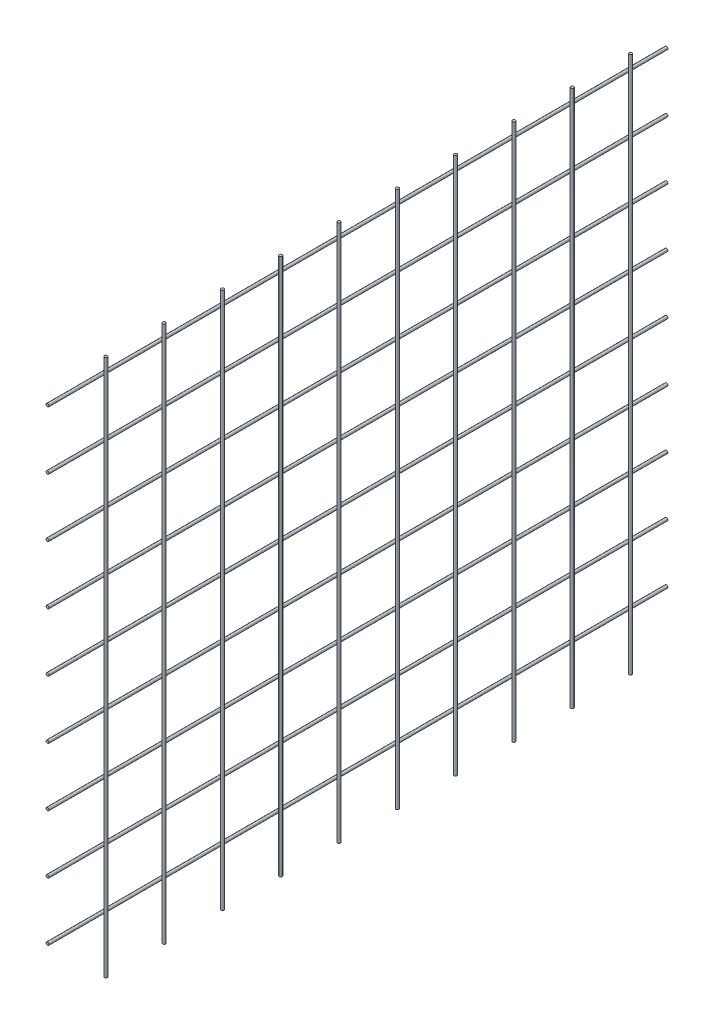
ISO-10303-21;
HEADER;
FILE_DESCRIPTION(('STEP AP214'),'2;1');
FILE_NAME('part.step','',(''),(''),'','','');
FILE_SCHEMA(('AUTOMOTIVE_DESIGN { 1 0 10303 214 1 1 1 1 }'));
ENDSEC;
DATA;
#1=APPLICATION_CONTEXT('core data for automotive mechanical design processes');
#2=APPLICATION_PROTOCOL_DEFINITION('international standard','automotive_design',2000,#1);
#3=PRODUCT_CONTEXT('',#1,'mechanical');
#4=PRODUCT('Part','Part','',(#3));
#5=PRODUCT_RELATED_PRODUCT_CATEGORY('part','',(#4));
#6=PRODUCT_DEFINITION_FORMATION('','',#4);
#7=PRODUCT_DEFINITION_CONTEXT('part definition',#1,'design');
#8=PRODUCT_DEFINITION('design','',#6,#7);
#9=PRODUCT_DEFINITION_SHAPE('','',#8);
#10=(LENGTH_UNIT() NAMED_UNIT(*) SI_UNIT(.MILLI.,.METRE.));
#11=(NAMED_UNIT(*) PLANE_ANGLE_UNIT() SI_UNIT($,.RADIAN.));
#12=(NAMED_UNIT(*) SI_UNIT($,.STERADIAN.) SOLID_ANGLE_UNIT());
#13=UNCERTAINTY_MEASURE_WITH_UNIT(LENGTH_MEASURE(1.E-05),#10,'distance_accuracy_value','');
#14=(GEOMETRIC_REPRESENTATION_CONTEXT(3) GLOBAL_UNCERTAINTY_ASSIGNED_CONTEXT((#13)) GLOBAL_UNIT_ASSIGNED_CONTEXT((#10,
#11,#12)) REPRESENTATION_CONTEXT('',''));
#15=CARTESIAN_POINT('',(0.,0.,0.));
#16=DIRECTION('',(0.,0.,1.));
#17=DIRECTION('',(1.,0.,0.));
#18=AXIS2_PLACEMENT_3D('',#15,#16,#17);
#19=CARTESIAN_POINT('',(1.68094704822153E-12,820.000000000028,-3080.002));
#20=DIRECTION('',(0.,0.,1.));
#21=DIRECTION('',(0.999999999999993,0.,0.));
#22=AXIS2_PLACEMENT_3D('',#19,#20,#21);
#23=CYLINDRICAL_SURFACE('',#22,1.49999999999989);
#24=CARTESIAN_POINT('',(4.56926163572291E-12,820.000000000028,-3040.));
#25=DIRECTION('',(0.,0.,-1.));
#26=DIRECTION('',(-0.999999999999993,0.,0.));
#27=AXIS2_PLACEMENT_3D('',#24,#25,#26);
#28=CIRCLE('',#27,1.49999999999989);
#29=CARTESIAN_POINT('',(-1.49999999999531,820.000000000028,-3040.));
#30=VERTEX_POINT('',#29);
#31=EDGE_CURVE('E11',#30,#30,#28,.T.);
#32=ORIENTED_EDGE('',*,*,#31,.F.);
#33=EDGE_LOOP('',(#32));
#34=FACE_BOUND('',#33,.T.);
#35=CARTESIAN_POINT('',(2.60035049048923E-12,820.000000000025,-2403.));
#36=DIRECTION('',(0.,0.,1.));
#37=DIRECTION('',(0.999999999999993,0.,0.));
#38=AXIS2_PLACEMENT_3D('',#35,#36,#37);
#39=CIRCLE('',#38,1.49999999999989);
#40=CARTESIAN_POINT('',(1.50000000000248,820.000000000025,-2403.));
#41=VERTEX_POINT('',#40);
#42=EDGE_CURVE('E61',#41,#41,#39,.T.);
#43=ORIENTED_EDGE('',*,*,#42,.F.);
#44=EDGE_LOOP('',(#43));
#45=FACE_BOUND('',#44,.T.);
#46=ADVANCED_FACE('F58',(#34,#45),#23,.T.);
#47=CARTESIAN_POINT('',(-15.4999999999984,1.46306577963884E-11,-3040.));
#48=DIRECTION('',(0.,0.,-1.));
#49=DIRECTION('',(-0.999999999999993,0.,0.));
#50=AXIS2_PLACEMENT_3D('',#47,#48,#49);
#51=PLANE('',#50);
#52=ORIENTED_EDGE('',*,*,#31,.T.);
#53=EDGE_LOOP('',(#52));
#54=FACE_BOUND('',#53,.T.);
#55=ADVANCED_FACE('F79',(#54),#51,.T.);
#56=CARTESIAN_POINT('',(-20.0100000000001,1256.50000000002,-2403.00000000001));
#57=DIRECTION('',(0.,0.,1.));
#58=DIRECTION('',(0.999999999999993,0.,0.));
#59=AXIS2_PLACEMENT_3D('',#56,#57,#58);
#60=PLANE('',#59);
#61=ORIENTED_EDGE('',*,*,#42,.T.);
#62=EDGE_LOOP('',(#61));
#63=FACE_BOUND('',#62,.T.);
#64=ADVANCED_FACE('F76',(#63),#60,.T.);
#65=CLOSED_SHELL('',(#46,#55,#64));
#66=MANIFOLD_SOLID_BREP('B2',#65);
#67=CARTESIAN_POINT('',(1.6826817716975E-12,880.000000000028,-3080.002));
#68=DIRECTION('',(0.,0.,1.));
#69=DIRECTION('',(0.999999999999993,0.,0.));
#70=AXIS2_PLACEMENT_3D('',#67,#68,#69);
#71=CYLINDRICAL_SURFACE('',#70,1.49999999999989);
#72=CARTESIAN_POINT('',(4.57099635919889E-12,880.000000000028,-3040.));
#73=DIRECTION('',(0.,0.,-1.));
#74=DIRECTION('',(-0.999999999999993,0.,0.));
#75=AXIS2_PLACEMENT_3D('',#72,#73,#74);
#76=CIRCLE('',#75,1.49999999999989);
#77=CARTESIAN_POINT('',(-1.49999999999531,880.000000000028,-3040.));
#78=VERTEX_POINT('',#77);
#79=EDGE_CURVE('E57',#78,#78,#76,.T.);
#80=ORIENTED_EDGE('',*,*,#79,.F.);
#81=EDGE_LOOP('',(#80));
#82=FACE_BOUND('',#81,.T.);
#83=CARTESIAN_POINT('',(2.60208521396521E-12,880.000000000024,-2403.));
#84=DIRECTION('',(0.,0.,1.));
#85=DIRECTION('',(0.999999999999993,0.,0.));
#86=AXIS2_PLACEMENT_3D('',#83,#84,#85);
#87=CIRCLE('',#86,1.49999999999989);
#88=CARTESIAN_POINT('',(1.50000000000248,880.000000000024,-2403.));
#89=VERTEX_POINT('',#88);
#90=EDGE_CURVE('E110',#89,#89,#87,.T.);
#91=ORIENTED_EDGE('',*,*,#90,.F.);
#92=EDGE_LOOP('',(#91));
#93=FACE_BOUND('',#92,.T.);
#94=ADVANCED_FACE('F107',(#82,#93),#71,.T.);
#95=CARTESIAN_POINT('',(-15.4999999999984,1.46306577963884E-11,-3040.));
#96=DIRECTION('',(0.,0.,-1.));
#97=DIRECTION('',(-0.999999999999993,0.,0.));
#98=AXIS2_PLACEMENT_3D('',#95,#96,#97);
#99=PLANE('',#98);
#100=ORIENTED_EDGE('',*,*,#79,.T.);
#101=EDGE_LOOP('',(#100));
#102=FACE_BOUND('',#101,.T.);
#103=ADVANCED_FACE('F128',(#102),#99,.T.);
#104=CARTESIAN_POINT('',(-20.0100000000001,1256.50000000002,-2403.00000000001));
#105=DIRECTION('',(0.,0.,1.));
#106=DIRECTION('',(0.999999999999993,0.,0.));
#107=AXIS2_PLACEMENT_3D('',#104,#105,#106);
#108=PLANE('',#107);
#109=ORIENTED_EDGE('',*,*,#90,.T.);
#110=EDGE_LOOP('',(#109));
#111=FACE_BOUND('',#110,.T.);
#112=ADVANCED_FACE('F125',(#111),#108,.T.);
#113=CLOSED_SHELL('',(#94,#103,#112));
#114=MANIFOLD_SOLID_BREP('B6',#113);
#115=CARTESIAN_POINT('',(1.68962066560141E-12,1000.00000000003,-3080.002));
#116=DIRECTION('',(0.,0.,1.));
#117=DIRECTION('',(0.999999999999993,0.,0.));
#118=AXIS2_PLACEMENT_3D('',#115,#116,#117);
#119=CYLINDRICAL_SURFACE('',#118,1.49999999999989);
#120=CARTESIAN_POINT('',(4.57793525310279E-12,1000.00000000003,-3040.));
#121=DIRECTION('',(0.,0.,-1.));
#122=DIRECTION('',(-0.999999999999993,0.,0.));
#123=AXIS2_PLACEMENT_3D('',#120,#121,#122);
#124=CIRCLE('',#123,1.49999999999989);
#125=CARTESIAN_POINT('',(-1.4999999999953,1000.00000000003,-3040.));
#126=VERTEX_POINT('',#125);
#127=EDGE_CURVE('E106',#126,#126,#124,.T.);
#128=ORIENTED_EDGE('',*,*,#127,.F.);
#129=EDGE_LOOP('',(#128));
#130=FACE_BOUND('',#129,.T.);
#131=CARTESIAN_POINT('',(3.94129173741931E-12,1000.00000000003,-2403.));
#132=DIRECTION('',(0.,0.,1.));
#133=DIRECTION('',(0.999999999999993,0.,0.));
#134=AXIS2_PLACEMENT_3D('',#131,#132,#133);
#135=CIRCLE('',#134,1.49999999999989);
#136=CARTESIAN_POINT('',(1.50000000000382,1000.00000000003,-2403.));
#137=VERTEX_POINT('',#136);
#138=EDGE_CURVE('E159',#137,#137,#135,.T.);
#139=ORIENTED_EDGE('',*,*,#138,.F.);
#140=EDGE_LOOP('',(#139));
#141=FACE_BOUND('',#140,.T.);
#142=ADVANCED_FACE('F156',(#130,#141),#119,.T.);
#143=CARTESIAN_POINT('',(-15.4999999999984,1.46306577963884E-11,-3040.));
#144=DIRECTION('',(0.,0.,-1.));
#145=DIRECTION('',(-0.999999999999993,0.,0.));
#146=AXIS2_PLACEMENT_3D('',#143,#144,#145);
#147=PLANE('',#146);
#148=ORIENTED_EDGE('',*,*,#127,.T.);
#149=EDGE_LOOP('',(#148));
#150=FACE_BOUND('',#149,.T.);
#151=ADVANCED_FACE('F177',(#150),#147,.T.);
#152=CARTESIAN_POINT('',(-20.0100000000001,1256.50000000002,-2403.00000000001));
#153=DIRECTION('',(0.,0.,1.));
#154=DIRECTION('',(0.999999999999993,0.,0.));
#155=AXIS2_PLACEMENT_3D('',#152,#153,#154);
#156=PLANE('',#155);
#157=ORIENTED_EDGE('',*,*,#138,.T.);
#158=EDGE_LOOP('',(#157));
#159=FACE_BOUND('',#158,.T.);
#160=ADVANCED_FACE('F174',(#159),#156,.T.);
#161=CLOSED_SHELL('',(#142,#151,#160));
#162=MANIFOLD_SOLID_BREP('B52',#161);
#163=CARTESIAN_POINT('',(1.68615121864946E-12,940.000000000028,-3080.002));
#164=DIRECTION('',(0.,0.,1.));
#165=DIRECTION('',(0.999999999999993,0.,0.));
#166=AXIS2_PLACEMENT_3D('',#163,#164,#165);
#167=CYLINDRICAL_SURFACE('',#166,1.49999999999989);
#168=CARTESIAN_POINT('',(4.57446580615084E-12,940.000000000028,-3040.));
#169=DIRECTION('',(0.,0.,-1.));
#170=DIRECTION('',(-0.999999999999993,0.,0.));
#171=AXIS2_PLACEMENT_3D('',#168,#169,#170);
#172=CIRCLE('',#171,1.49999999999989);
#173=CARTESIAN_POINT('',(-1.4999999999953,940.000000000028,-3040.));
#174=VERTEX_POINT('',#173);
#175=EDGE_CURVE('E155',#174,#174,#172,.T.);
#176=ORIENTED_EDGE('',*,*,#175,.F.);
#177=EDGE_LOOP('',(#176));
#178=FACE_BOUND('',#177,.T.);
#179=CARTESIAN_POINT('',(3.93782229046735E-12,940.000000000026,-2403.));
#180=DIRECTION('',(0.,0.,1.));
#181=DIRECTION('',(0.999999999999993,0.,0.));
#182=AXIS2_PLACEMENT_3D('',#179,#180,#181);
#183=CIRCLE('',#182,1.49999999999989);
#184=CARTESIAN_POINT('',(1.50000000000381,940.000000000026,-2403.));
#185=VERTEX_POINT('',#184);
#186=EDGE_CURVE('E208',#185,#185,#183,.T.);
#187=ORIENTED_EDGE('',*,*,#186,.F.);
#188=EDGE_LOOP('',(#187));
#189=FACE_BOUND('',#188,.T.);
#190=ADVANCED_FACE('F205',(#178,#189),#167,.T.);
#191=CARTESIAN_POINT('',(-15.4999999999984,1.46306577963884E-11,-3040.));
#192=DIRECTION('',(0.,0.,-1.));
#193=DIRECTION('',(-0.999999999999993,0.,0.));
#194=AXIS2_PLACEMENT_3D('',#191,#192,#193);
#195=PLANE('',#194);
#196=ORIENTED_EDGE('',*,*,#175,.T.);
#197=EDGE_LOOP('',(#196));
#198=FACE_BOUND('',#197,.T.);
#199=ADVANCED_FACE('F226',(#198),#195,.T.);
#200=CARTESIAN_POINT('',(-20.0100000000001,1256.50000000002,-2403.00000000001));
#201=DIRECTION('',(0.,0.,1.));
#202=DIRECTION('',(0.999999999999993,0.,0.));
#203=AXIS2_PLACEMENT_3D('',#200,#201,#202);
#204=PLANE('',#203);
#205=ORIENTED_EDGE('',*,*,#186,.T.);
#206=EDGE_LOOP('',(#205));
#207=FACE_BOUND('',#206,.T.);
#208=ADVANCED_FACE('F223',(#207),#204,.T.);
#209=CLOSED_SHELL('',(#190,#199,#208));
#210=MANIFOLD_SOLID_BREP('B101',#209);
#211=CARTESIAN_POINT('',(1.69309011255336E-12,1060.00000000003,-3080.002));
#212=DIRECTION('',(0.,0.,1.));
#213=DIRECTION('',(0.999999999999993,0.,0.));
#214=AXIS2_PLACEMENT_3D('',#211,#212,#213);
#215=CYLINDRICAL_SURFACE('',#214,1.49999999999989);
#216=CARTESIAN_POINT('',(4.58140470005475E-12,1060.00000000003,-3040.));
#217=DIRECTION('',(0.,0.,-1.));
#218=DIRECTION('',(-0.999999999999993,0.,0.));
#219=AXIS2_PLACEMENT_3D('',#216,#217,#218);
#220=CIRCLE('',#219,1.49999999999989);
#221=CARTESIAN_POINT('',(-1.49999999999529,1060.00000000003,-3040.));
#222=VERTEX_POINT('',#221);
#223=EDGE_CURVE('E204',#222,#222,#220,.T.);
#224=ORIENTED_EDGE('',*,*,#223,.F.);
#225=EDGE_LOOP('',(#224));
#226=FACE_BOUND('',#225,.T.);
#227=CARTESIAN_POINT('',(3.94476118437126E-12,1060.00000000003,-2403.));
#228=DIRECTION('',(0.,0.,1.));
#229=DIRECTION('',(0.999999999999993,0.,0.));
#230=AXIS2_PLACEMENT_3D('',#227,#228,#229);
#231=CIRCLE('',#230,1.49999999999989);
#232=CARTESIAN_POINT('',(1.50000000000382,1060.00000000003,-2403.));
#233=VERTEX_POINT('',#232);
#234=EDGE_CURVE('E257',#233,#233,#231,.T.);
#235=ORIENTED_EDGE('',*,*,#234,.F.);
#236=EDGE_LOOP('',(#235));
#237=FACE_BOUND('',#236,.T.);
#238=ADVANCED_FACE('F254',(#226,#237),#215,.T.);
#239=CARTESIAN_POINT('',(-15.4999999999984,1.46306577963884E-11,-3040.));
#240=DIRECTION('',(0.,0.,-1.));
#241=DIRECTION('',(-0.999999999999993,0.,0.));
#242=AXIS2_PLACEMENT_3D('',#239,#240,#241);
#243=PLANE('',#242);
#244=ORIENTED_EDGE('',*,*,#223,.T.);
#245=EDGE_LOOP('',(#244));
#246=FACE_BOUND('',#245,.T.);
#247=ADVANCED_FACE('F275',(#246),#243,.T.);
#248=CARTESIAN_POINT('',(-20.0100000000001,1256.50000000002,-2403.00000000001));
#249=DIRECTION('',(0.,0.,1.));
#250=DIRECTION('',(0.999999999999993,0.,0.));
#251=AXIS2_PLACEMENT_3D('',#248,#249,#250);
#252=PLANE('',#251);
#253=ORIENTED_EDGE('',*,*,#234,.T.);
#254=EDGE_LOOP('',(#253));
#255=FACE_BOUND('',#254,.T.);
#256=ADVANCED_FACE('F272',(#255),#252,.T.);
#257=CLOSED_SHELL('',(#238,#247,#256));
#258=MANIFOLD_SOLID_BREP('B150',#257);
#259=CARTESIAN_POINT('',(4.58313942353072E-12,1120.00000000003,-3080.002));
#260=DIRECTION('',(0.,0.,1.));
#261=DIRECTION('',(0.999999999999993,0.,0.));
#262=AXIS2_PLACEMENT_3D('',#259,#260,#261);
#263=CYLINDRICAL_SURFACE('',#262,1.49999999999989);
#264=CARTESIAN_POINT('',(4.80691875193173E-12,1120.00000000003,-3040.));
#265=DIRECTION('',(0.,0.,-1.));
#266=DIRECTION('',(-0.999999999999993,0.,0.));
#267=AXIS2_PLACEMENT_3D('',#264,#265,#266);
#268=CIRCLE('',#267,1.49999999999989);
#269=CARTESIAN_POINT('',(-1.49999999999507,1120.00000000003,-3040.));
#270=VERTEX_POINT('',#269);
#271=EDGE_CURVE('E253',#270,#270,#268,.T.);
#272=ORIENTED_EDGE('',*,*,#271,.F.);
#273=EDGE_LOOP('',(#272));
#274=FACE_BOUND('',#273,.T.);
#275=CARTESIAN_POINT('',(4.17027523624824E-12,1120.00000000003,-2403.));
#276=DIRECTION('',(0.,0.,1.));
#277=DIRECTION('',(0.999999999999993,0.,0.));
#278=AXIS2_PLACEMENT_3D('',#275,#276,#277);
#279=CIRCLE('',#278,1.49999999999989);
#280=CARTESIAN_POINT('',(1.50000000000405,1120.00000000003,-2403.));
#281=VERTEX_POINT('',#280);
#282=EDGE_CURVE('E306',#281,#281,#279,.T.);
#283=ORIENTED_EDGE('',*,*,#282,.F.);
#284=EDGE_LOOP('',(#283));
#285=FACE_BOUND('',#284,.T.);
#286=ADVANCED_FACE('F303',(#274,#285),#263,.T.);
#287=CARTESIAN_POINT('',(-15.4999999999984,1.46306577963884E-11,-3040.));
#288=DIRECTION('',(0.,0.,-1.));
#289=DIRECTION('',(-0.999999999999993,0.,0.));
#290=AXIS2_PLACEMENT_3D('',#287,#288,#289);
#291=PLANE('',#290);
#292=ORIENTED_EDGE('',*,*,#271,.T.);
#293=EDGE_LOOP('',(#292));
#294=FACE_BOUND('',#293,.T.);
#295=ADVANCED_FACE('F324',(#294),#291,.T.);
#296=CARTESIAN_POINT('',(-20.0100000000001,1256.50000000002,-2403.00000000001));
#297=DIRECTION('',(0.,0.,1.));
#298=DIRECTION('',(0.999999999999993,0.,0.));
#299=AXIS2_PLACEMENT_3D('',#296,#297,#298);
#300=PLANE('',#299);
#301=ORIENTED_EDGE('',*,*,#282,.T.);
#302=EDGE_LOOP('',(#301));
#303=FACE_BOUND('',#302,.T.);
#304=ADVANCED_FACE('F321',(#303),#300,.T.);
#305=CLOSED_SHELL('',(#286,#295,#304));
#306=MANIFOLD_SOLID_BREP('B199',#305);
#307=CARTESIAN_POINT('',(4.58660887048268E-12,1180.00000000003,-3080.002));
#308=DIRECTION('',(0.,0.,1.));
#309=DIRECTION('',(0.999999999999993,0.,0.));
#310=AXIS2_PLACEMENT_3D('',#307,#308,#309);
#311=CYLINDRICAL_SURFACE('',#310,1.49999999999989);
#312=CARTESIAN_POINT('',(4.81038819888369E-12,1180.00000000003,-3040.));
#313=DIRECTION('',(0.,0.,-1.));
#314=DIRECTION('',(-0.999999999999993,0.,0.));
#315=AXIS2_PLACEMENT_3D('',#312,#313,#314);
#316=CIRCLE('',#315,1.49999999999989);
#317=CARTESIAN_POINT('',(-1.49999999999507,1180.00000000003,-3040.));
#318=VERTEX_POINT('',#317);
#319=EDGE_CURVE('E302',#318,#318,#316,.T.);
#320=ORIENTED_EDGE('',*,*,#319,.F.);
#321=EDGE_LOOP('',(#320));
#322=FACE_BOUND('',#321,.T.);
#323=CARTESIAN_POINT('',(4.1737446832002E-12,1180.00000000003,-2403.));
#324=DIRECTION('',(0.,0.,1.));
#325=DIRECTION('',(0.999999999999993,0.,0.));
#326=AXIS2_PLACEMENT_3D('',#323,#324,#325);
#327=CIRCLE('',#326,1.49999999999989);
#328=CARTESIAN_POINT('',(1.50000000000405,1180.00000000003,-2403.));
#329=VERTEX_POINT('',#328);
#330=EDGE_CURVE('E355',#329,#329,#327,.T.);
#331=ORIENTED_EDGE('',*,*,#330,.F.);
#332=EDGE_LOOP('',(#331));
#333=FACE_BOUND('',#332,.T.);
#334=ADVANCED_FACE('F352',(#322,#333),#311,.T.);
#335=CARTESIAN_POINT('',(-15.4999999999984,1.46306577963884E-11,-3040.));
#336=DIRECTION('',(0.,0.,-1.));
#337=DIRECTION('',(-0.999999999999993,0.,0.));
#338=AXIS2_PLACEMENT_3D('',#335,#336,#337);
#339=PLANE('',#338);
#340=ORIENTED_EDGE('',*,*,#319,.T.);
#341=EDGE_LOOP('',(#340));
#342=FACE_BOUND('',#341,.T.);
#343=ADVANCED_FACE('F373',(#342),#339,.T.);
#344=CARTESIAN_POINT('',(-20.0100000000001,1256.50000000002,-2403.00000000001));
#345=DIRECTION('',(0.,0.,1.));
#346=DIRECTION('',(0.999999999999993,0.,0.));
#347=AXIS2_PLACEMENT_3D('',#344,#345,#346);
#348=PLANE('',#347);
#349=ORIENTED_EDGE('',*,*,#330,.T.);
#350=EDGE_LOOP('',(#349));
#351=FACE_BOUND('',#350,.T.);
#352=ADVANCED_FACE('F370',(#351),#348,.T.);
#353=CLOSED_SHELL('',(#334,#343,#352));
#354=MANIFOLD_SOLID_BREP('B248',#353);
#355=CARTESIAN_POINT('',(4.81038819888369E-12,1240.00000000003,-3080.002));
#356=DIRECTION('',(0.,0.,1.));
#357=DIRECTION('',(0.999999999999993,0.,0.));
#358=AXIS2_PLACEMENT_3D('',#355,#356,#357);
#359=CYLINDRICAL_SURFACE('',#358,1.49999999999989);
#360=CARTESIAN_POINT('',(4.81212292235966E-12,1240.00000000003,-3040.));
#361=DIRECTION('',(0.,0.,-1.));
#362=DIRECTION('',(-0.999999999999993,0.,0.));
#363=AXIS2_PLACEMENT_3D('',#360,#361,#362);
#364=CIRCLE('',#363,1.49999999999989);
#365=CARTESIAN_POINT('',(-1.49999999999506,1240.00000000003,-3040.));
#366=VERTEX_POINT('',#365);
#367=EDGE_CURVE('E351',#366,#366,#364,.T.);
#368=ORIENTED_EDGE('',*,*,#367,.F.);
#369=EDGE_LOOP('',(#368));
#370=FACE_BOUND('',#369,.T.);
#371=CARTESIAN_POINT('',(4.17547940667617E-12,1240.00000000003,-2403.));
#372=DIRECTION('',(0.,0.,1.));
#373=DIRECTION('',(0.999999999999993,0.,0.));
#374=AXIS2_PLACEMENT_3D('',#371,#372,#373);
#375=CIRCLE('',#374,1.49999999999989);
#376=CARTESIAN_POINT('',(1.50000000000405,1240.00000000003,-2403.));
#377=VERTEX_POINT('',#376);
#378=EDGE_CURVE('E404',#377,#377,#375,.T.);
#379=ORIENTED_EDGE('',*,*,#378,.F.);
#380=EDGE_LOOP('',(#379));
#381=FACE_BOUND('',#380,.T.);
#382=ADVANCED_FACE('F401',(#370,#381),#359,.T.);
#383=CARTESIAN_POINT('',(-15.4999999999984,1.46306577963884E-11,-3040.));
#384=DIRECTION('',(0.,0.,-1.));
#385=DIRECTION('',(-0.999999999999993,0.,0.));
#386=AXIS2_PLACEMENT_3D('',#383,#384,#385);
#387=PLANE('',#386);
#388=ORIENTED_EDGE('',*,*,#367,.T.);
#389=EDGE_LOOP('',(#388));
#390=FACE_BOUND('',#389,.T.);
#391=ADVANCED_FACE('F422',(#390),#387,.T.);
#392=CARTESIAN_POINT('',(-20.0100000000001,1256.50000000002,-2403.00000000001));
#393=DIRECTION('',(0.,0.,1.));
#394=DIRECTION('',(0.999999999999993,0.,0.));
#395=AXIS2_PLACEMENT_3D('',#392,#393,#394);
#396=PLANE('',#395);
#397=ORIENTED_EDGE('',*,*,#378,.T.);
#398=EDGE_LOOP('',(#397));
#399=FACE_BOUND('',#398,.T.);
#400=ADVANCED_FACE('F419',(#399),#396,.T.);
#401=CLOSED_SHELL('',(#382,#391,#400));
#402=MANIFOLD_SOLID_BREP('B297',#401);
#403=CARTESIAN_POINT('',(3.0000000000043,1980.00200000004,-3000.00000000001));
#404=DIRECTION('',(0.,-1.00000000000001,0.));
#405=DIRECTION('',(0.,0.,-1.));
#406=AXIS2_PLACEMENT_3D('',#403,#404,#405);
#407=CYLINDRICAL_SURFACE('',#406,1.5);
#408=CARTESIAN_POINT('',(3.00000000000249,1256.50000000003,-3000.));
#409=DIRECTION('',(0.,1.00000000000001,0.));
#410=DIRECTION('',(0.,0.,1.));
#411=AXIS2_PLACEMENT_3D('',#408,#409,#410);
#412=CIRCLE('',#411,1.5);
#413=CARTESIAN_POINT('',(3.00000000000249,1256.50000000003,-2998.5));
#414=VERTEX_POINT('',#413);
#415=EDGE_CURVE('E457',#414,#414,#412,.T.);
#416=ORIENTED_EDGE('',*,*,#415,.F.);
#417=EDGE_LOOP('',(#416));
#418=FACE_BOUND('',#417,.T.);
#419=CARTESIAN_POINT('',(3.00000000000357,703.500000000023,-3000.));
#420=DIRECTION('',(0.,-1.00000000000001,0.));
#421=DIRECTION('',(0.,0.,-1.));
#422=AXIS2_PLACEMENT_3D('',#419,#420,#421);
#423=CIRCLE('',#422,1.5);
#424=CARTESIAN_POINT('',(3.00000000000357,703.500000000023,-3001.5));
#425=VERTEX_POINT('',#424);
#426=EDGE_CURVE('E400',#425,#425,#423,.T.);
#427=ORIENTED_EDGE('',*,*,#426,.F.);
#428=EDGE_LOOP('',(#427));
#429=FACE_BOUND('',#428,.T.);
#430=ADVANCED_FACE('F450',(#418,#429),#407,.T.);
#431=CARTESIAN_POINT('',(-20.0100000000001,1256.50000000002,-2403.00000000001));
#432=DIRECTION('',(0.,1.00000000000001,0.));
#433=DIRECTION('',(0.,0.,1.));
#434=AXIS2_PLACEMENT_3D('',#431,#432,#433);
#435=PLANE('',#434);
#436=ORIENTED_EDGE('',*,*,#415,.T.);
#437=EDGE_LOOP('',(#436));
#438=FACE_BOUND('',#437,.T.);
#439=ADVANCED_FACE('F468',(#438),#435,.T.);
#440=CARTESIAN_POINT('',(-20.0099999999975,703.500000000021,-2403.00000000001));
#441=DIRECTION('',(0.,-1.00000000000001,0.));
#442=DIRECTION('',(0.,0.,-1.));
#443=AXIS2_PLACEMENT_3D('',#440,#441,#442);
#444=PLANE('',#443);
#445=ORIENTED_EDGE('',*,*,#426,.T.);
#446=EDGE_LOOP('',(#445));
#447=FACE_BOUND('',#446,.T.);
#448=ADVANCED_FACE('F472',(#447),#444,.T.);
#449=CLOSED_SHELL('',(#430,#439,#448));
#450=MANIFOLD_SOLID_BREP('B346',#449);
#451=CARTESIAN_POINT('',(3.0000000000063,1980.00200000004,-2940.00000000001));
#452=DIRECTION('',(0.,-1.00000000000001,0.));
#453=DIRECTION('',(0.,0.,-1.));
#454=AXIS2_PLACEMENT_3D('',#451,#452,#453);
#455=CYLINDRICAL_SURFACE('',#454,1.5);
#456=CARTESIAN_POINT('',(3.00000000000182,1256.50000000003,-2940.));
#457=DIRECTION('',(0.,1.00000000000001,0.));
#458=DIRECTION('',(0.,0.,1.));
#459=AXIS2_PLACEMENT_3D('',#456,#457,#458);
#460=CIRCLE('',#459,1.5);
#461=CARTESIAN_POINT('',(3.00000000000182,1256.50000000003,-2938.5));
#462=VERTEX_POINT('',#461);
#463=EDGE_CURVE('E509',#462,#462,#460,.T.);
#464=ORIENTED_EDGE('',*,*,#463,.F.);
#465=EDGE_LOOP('',(#464));
#466=FACE_BOUND('',#465,.T.);
#467=CARTESIAN_POINT('',(3.00000000000446,703.500000000023,-2940.));
#468=DIRECTION('',(0.,-1.00000000000001,0.));
#469=DIRECTION('',(0.,0.,-1.));
#470=AXIS2_PLACEMENT_3D('',#467,#468,#469);
#471=CIRCLE('',#470,1.5);
#472=CARTESIAN_POINT('',(3.00000000000446,703.500000000023,-2941.5));
#473=VERTEX_POINT('',#472);
#474=EDGE_CURVE('E449',#473,#473,#471,.T.);
#475=ORIENTED_EDGE('',*,*,#474,.F.);
#476=EDGE_LOOP('',(#475));
#477=FACE_BOUND('',#476,.T.);
#478=ADVANCED_FACE('F502',(#466,#477),#455,.T.);
#479=CARTESIAN_POINT('',(-20.0100000000001,1256.50000000002,-2403.00000000001));
#480=DIRECTION('',(0.,1.00000000000001,0.));
#481=DIRECTION('',(0.,0.,1.));
#482=AXIS2_PLACEMENT_3D('',#479,#480,#481);
#483=PLANE('',#482);
#484=ORIENTED_EDGE('',*,*,#463,.T.);
#485=EDGE_LOOP('',(#484));
#486=FACE_BOUND('',#485,.T.);
#487=ADVANCED_FACE('F520',(#486),#483,.T.);
#488=CARTESIAN_POINT('',(-20.0099999999975,703.500000000021,-2403.00000000001));
#489=DIRECTION('',(0.,-1.00000000000001,0.));
#490=DIRECTION('',(0.,0.,-1.));
#491=AXIS2_PLACEMENT_3D('',#488,#489,#490);
#492=PLANE('',#491);
#493=ORIENTED_EDGE('',*,*,#474,.T.);
#494=EDGE_LOOP('',(#493));
#495=FACE_BOUND('',#494,.T.);
#496=ADVANCED_FACE('F524',(#495),#492,.T.);
#497=CLOSED_SHELL('',(#478,#487,#496));
#498=MANIFOLD_SOLID_BREP('B395',#497);
#499=CARTESIAN_POINT('',(3.00000000000233,1980.00200000003,-2880.00000000001));
#500=DIRECTION('',(0.,-1.00000000000001,0.));
#501=DIRECTION('',(0.,0.,-1.));
#502=AXIS2_PLACEMENT_3D('',#499,#500,#501);
#503=CYLINDRICAL_SURFACE('',#502,1.5);
#504=CARTESIAN_POINT('',(3.00000000000167,1256.50000000002,-2880.));
#505=DIRECTION('',(0.,1.00000000000001,0.));
#506=DIRECTION('',(0.,0.,1.));
#507=AXIS2_PLACEMENT_3D('',#504,#505,#506);
#508=CIRCLE('',#507,1.5);
#509=CARTESIAN_POINT('',(3.00000000000167,1256.50000000002,-2878.5));
#510=VERTEX_POINT('',#509);
#511=EDGE_CURVE('E564',#510,#510,#508,.T.);
#512=ORIENTED_EDGE('',*,*,#511,.F.);
#513=EDGE_LOOP('',(#512));
#514=FACE_BOUND('',#513,.T.);
#515=CARTESIAN_POINT('',(3.00000000000189,703.500000000017,-2880.));
#516=DIRECTION('',(0.,-1.00000000000001,0.));
#517=DIRECTION('',(0.,0.,-1.));
#518=AXIS2_PLACEMENT_3D('',#515,#516,#517);
#519=CIRCLE('',#518,1.5);
#520=CARTESIAN_POINT('',(3.00000000000189,703.500000000017,-2881.5));
#521=VERTEX_POINT('',#520);
#522=EDGE_CURVE('E501',#521,#521,#519,.T.);
#523=ORIENTED_EDGE('',*,*,#522,.F.);
#524=EDGE_LOOP('',(#523));
#525=FACE_BOUND('',#524,.T.);
#526=ADVANCED_FACE('F557',(#514,#525),#503,.T.);
#527=CARTESIAN_POINT('',(-20.0100000000001,1256.50000000002,-2403.00000000001));
#528=DIRECTION('',(0.,1.00000000000001,0.));
#529=DIRECTION('',(0.,0.,1.));
#530=AXIS2_PLACEMENT_3D('',#527,#528,#529);
#531=PLANE('',#530);
#532=ORIENTED_EDGE('',*,*,#511,.T.);
#533=EDGE_LOOP('',(#532));
#534=FACE_BOUND('',#533,.T.);
#535=ADVANCED_FACE('F575',(#534),#531,.T.);
#536=CARTESIAN_POINT('',(-20.0099999999961,703.500000000016,-2403.00000000001));
#537=DIRECTION('',(0.,-1.00000000000001,0.));
#538=DIRECTION('',(0.,0.,-1.));
#539=AXIS2_PLACEMENT_3D('',#536,#537,#538);
#540=PLANE('',#539);
#541=ORIENTED_EDGE('',*,*,#522,.T.);
#542=EDGE_LOOP('',(#541));
#543=FACE_BOUND('',#542,.T.);
#544=ADVANCED_FACE('F579',(#543),#540,.T.);
#545=CLOSED_SHELL('',(#526,#535,#544));
#546=MANIFOLD_SOLID_BREP('B444',#545);
#547=CARTESIAN_POINT('',(3.00000000000433,1980.00200000003,-2820.00000000001));
#548=DIRECTION('',(0.,-1.00000000000001,0.));
#549=DIRECTION('',(0.,0.,-1.));
#550=AXIS2_PLACEMENT_3D('',#547,#548,#549);
#551=CYLINDRICAL_SURFACE('',#550,1.5);
#552=CARTESIAN_POINT('',(3.00000000000389,1256.50000000002,-2820.));
#553=DIRECTION('',(0.,1.00000000000001,0.));
#554=DIRECTION('',(0.,0.,1.));
#555=AXIS2_PLACEMENT_3D('',#552,#553,#554);
#556=CIRCLE('',#555,1.5);
#557=CARTESIAN_POINT('',(3.00000000000389,1256.50000000002,-2818.5));
#558=VERTEX_POINT('',#557);
#559=EDGE_CURVE('E614',#558,#558,#556,.T.);
#560=ORIENTED_EDGE('',*,*,#559,.F.);
#561=EDGE_LOOP('',(#560));
#562=FACE_BOUND('',#561,.T.);
#563=CARTESIAN_POINT('',(3.00000000000389,703.500000000017,-2820.));
#564=DIRECTION('',(0.,-1.00000000000001,0.));
#565=DIRECTION('',(0.,0.,-1.));
#566=AXIS2_PLACEMENT_3D('',#563,#564,#565);
#567=CIRCLE('',#566,1.5);
#568=CARTESIAN_POINT('',(3.00000000000389,703.500000000017,-2821.5));
#569=VERTEX_POINT('',#568);
#570=EDGE_CURVE('E556',#569,#569,#567,.T.);
#571=ORIENTED_EDGE('',*,*,#570,.F.);
#572=EDGE_LOOP('',(#571));
#573=FACE_BOUND('',#572,.T.);
#574=ADVANCED_FACE('F607',(#562,#573),#551,.T.);
#575=CARTESIAN_POINT('',(-20.0100000000001,1256.50000000002,-2403.00000000001));
#576=DIRECTION('',(0.,1.00000000000001,0.));
#577=DIRECTION('',(0.,0.,1.));
#578=AXIS2_PLACEMENT_3D('',#575,#576,#577);
#579=PLANE('',#578);
#580=ORIENTED_EDGE('',*,*,#559,.T.);
#581=EDGE_LOOP('',(#580));
#582=FACE_BOUND('',#581,.T.);
#583=ADVANCED_FACE('F625',(#582),#579,.T.);
#584=CARTESIAN_POINT('',(-20.0099999999961,703.500000000016,-2403.00000000001));
#585=DIRECTION('',(0.,-1.00000000000001,0.));
#586=DIRECTION('',(0.,0.,-1.));
#587=AXIS2_PLACEMENT_3D('',#584,#585,#586);
#588=PLANE('',#587);
#589=ORIENTED_EDGE('',*,*,#570,.T.);
#590=EDGE_LOOP('',(#589));
#591=FACE_BOUND('',#590,.T.);
#592=ADVANCED_FACE('F629',(#591),#588,.T.);
#593=CLOSED_SHELL('',(#574,#583,#592));
#594=MANIFOLD_SOLID_BREP('B496',#593);
#595=CARTESIAN_POINT('',(3.00000000000411,1980.00200000003,-2760.00000000001));
#596=DIRECTION('',(0.,-1.00000000000001,0.));
#597=DIRECTION('',(0.,0.,-1.));
#598=AXIS2_PLACEMENT_3D('',#595,#596,#597);
#599=CYLINDRICAL_SURFACE('',#598,1.5);
#600=CARTESIAN_POINT('',(2.99999999999989,1256.50000000002,-2760.));
#601=DIRECTION('',(0.,1.00000000000001,0.));
#602=DIRECTION('',(0.,0.,1.));
#603=AXIS2_PLACEMENT_3D('',#600,#601,#602);
#604=CIRCLE('',#603,1.5);
#605=CARTESIAN_POINT('',(2.99999999999989,1256.50000000002,-2758.5));
#606=VERTEX_POINT('',#605);
#607=EDGE_CURVE('E663',#606,#606,#604,.T.);
#608=ORIENTED_EDGE('',*,*,#607,.F.);
#609=EDGE_LOOP('',(#608));
#610=FACE_BOUND('',#609,.T.);
#611=CARTESIAN_POINT('',(3.00000000000367,703.500000000017,-2760.));
#612=DIRECTION('',(0.,-1.00000000000001,0.));
#613=DIRECTION('',(0.,0.,-1.));
#614=AXIS2_PLACEMENT_3D('',#611,#612,#613);
#615=CIRCLE('',#614,1.5);
#616=CARTESIAN_POINT('',(3.00000000000367,703.500000000017,-2761.5));
#617=VERTEX_POINT('',#616);
#618=EDGE_CURVE('E606',#617,#617,#615,.T.);
#619=ORIENTED_EDGE('',*,*,#618,.F.);
#620=EDGE_LOOP('',(#619));
#621=FACE_BOUND('',#620,.T.);
#622=ADVANCED_FACE('F656',(#610,#621),#599,.T.);
#623=CARTESIAN_POINT('',(-20.0100000000001,1256.50000000002,-2403.00000000001));
#624=DIRECTION('',(0.,1.00000000000001,0.));
#625=DIRECTION('',(0.,0.,1.));
#626=AXIS2_PLACEMENT_3D('',#623,#624,#625);
#627=PLANE('',#626);
#628=ORIENTED_EDGE('',*,*,#607,.T.);
#629=EDGE_LOOP('',(#628));
#630=FACE_BOUND('',#629,.T.);
#631=ADVANCED_FACE('F674',(#630),#627,.T.);
#632=CARTESIAN_POINT('',(-20.0099999999961,703.500000000016,-2403.00000000001));
#633=DIRECTION('',(0.,-1.00000000000001,0.));
#634=DIRECTION('',(0.,0.,-1.));
#635=AXIS2_PLACEMENT_3D('',#632,#633,#634);
#636=PLANE('',#635);
#637=ORIENTED_EDGE('',*,*,#618,.T.);
#638=EDGE_LOOP('',(#637));
#639=FACE_BOUND('',#638,.T.);
#640=ADVANCED_FACE('F678',(#639),#636,.T.);
#641=CLOSED_SHELL('',(#622,#631,#640));
#642=MANIFOLD_SOLID_BREP('B551',#641);
#643=CARTESIAN_POINT('',(3.00000000000233,1980.00200000003,-2700.00000000001));
#644=DIRECTION('',(0.,-1.00000000000001,0.));
#645=DIRECTION('',(0.,0.,-1.));
#646=AXIS2_PLACEMENT_3D('',#643,#644,#645);
#647=CYLINDRICAL_SURFACE('',#646,1.5);
#648=CARTESIAN_POINT('',(3.00000000000167,1256.50000000002,-2700.));
#649=DIRECTION('',(0.,1.00000000000001,0.));
#650=DIRECTION('',(0.,0.,1.));
#651=AXIS2_PLACEMENT_3D('',#648,#649,#650);
#652=CIRCLE('',#651,1.5);
#653=CARTESIAN_POINT('',(3.00000000000167,1256.50000000002,-2698.5));
#654=VERTEX_POINT('',#653);
#655=EDGE_CURVE('E712',#654,#654,#652,.T.);
#656=ORIENTED_EDGE('',*,*,#655,.F.);
#657=EDGE_LOOP('',(#656));
#658=FACE_BOUND('',#657,.T.);
#659=CARTESIAN_POINT('',(3.00000000000189,703.500000000017,-2700.));
#660=DIRECTION('',(0.,-1.00000000000001,0.));
#661=DIRECTION('',(0.,0.,-1.));
#662=AXIS2_PLACEMENT_3D('',#659,#660,#661);
#663=CIRCLE('',#662,1.5);
#664=CARTESIAN_POINT('',(3.00000000000189,703.500000000017,-2701.5));
#665=VERTEX_POINT('',#664);
#666=EDGE_CURVE('E655',#665,#665,#663,.T.);
#667=ORIENTED_EDGE('',*,*,#666,.F.);
#668=EDGE_LOOP('',(#667));
#669=FACE_BOUND('',#668,.T.);
#670=ADVANCED_FACE('F705',(#658,#669),#647,.T.);
#671=CARTESIAN_POINT('',(-20.0100000000001,1256.50000000002,-2403.00000000001));
#672=DIRECTION('',(0.,1.00000000000001,0.));
#673=DIRECTION('',(0.,0.,1.));
#674=AXIS2_PLACEMENT_3D('',#671,#672,#673);
#675=PLANE('',#674);
#676=ORIENTED_EDGE('',*,*,#655,.T.);
#677=EDGE_LOOP('',(#676));
#678=FACE_BOUND('',#677,.T.);
#679=ADVANCED_FACE('F723',(#678),#675,.T.);
#680=CARTESIAN_POINT('',(-20.0099999999961,703.500000000016,-2403.00000000001));
#681=DIRECTION('',(0.,-1.00000000000001,0.));
#682=DIRECTION('',(0.,0.,-1.));
#683=AXIS2_PLACEMENT_3D('',#680,#681,#682);
#684=PLANE('',#683);
#685=ORIENTED_EDGE('',*,*,#666,.T.);
#686=EDGE_LOOP('',(#685));
#687=FACE_BOUND('',#686,.T.);
#688=ADVANCED_FACE('F727',(#687),#684,.T.);
#689=CLOSED_SHELL('',(#670,#679,#688));
#690=MANIFOLD_SOLID_BREP('B601',#689);
#691=CARTESIAN_POINT('',(3.00000000000233,1980.00200000003,-2640.00000000001));
#692=DIRECTION('',(0.,-1.00000000000001,0.));
#693=DIRECTION('',(0.,0.,-1.));
#694=AXIS2_PLACEMENT_3D('',#691,#692,#693);
#695=CYLINDRICAL_SURFACE('',#694,1.5);
#696=CARTESIAN_POINT('',(3.00000000000167,1256.50000000002,-2640.));
#697=DIRECTION('',(0.,1.00000000000001,0.));
#698=DIRECTION('',(0.,0.,1.));
#699=AXIS2_PLACEMENT_3D('',#696,#697,#698);
#700=CIRCLE('',#699,1.5);
#701=CARTESIAN_POINT('',(3.00000000000167,1256.50000000002,-2638.5));
#702=VERTEX_POINT('',#701);
#703=EDGE_CURVE('E761',#702,#702,#700,.T.);
#704=ORIENTED_EDGE('',*,*,#703,.F.);
#705=EDGE_LOOP('',(#704));
#706=FACE_BOUND('',#705,.T.);
#707=CARTESIAN_POINT('',(3.00000000000189,703.500000000016,-2640.));
#708=DIRECTION('',(0.,-1.00000000000001,0.));
#709=DIRECTION('',(0.,0.,-1.));
#710=AXIS2_PLACEMENT_3D('',#707,#708,#709);
#711=CIRCLE('',#710,1.5);
#712=CARTESIAN_POINT('',(3.00000000000189,703.500000000016,-2641.5));
#713=VERTEX_POINT('',#712);
#714=EDGE_CURVE('E704',#713,#713,#711,.T.);
#715=ORIENTED_EDGE('',*,*,#714,.F.);
#716=EDGE_LOOP('',(#715));
#717=FACE_BOUND('',#716,.T.);
#718=ADVANCED_FACE('F754',(#706,#717),#695,.T.);
#719=CARTESIAN_POINT('',(-20.0100000000001,1256.50000000002,-2403.00000000001));
#720=DIRECTION('',(0.,1.00000000000001,0.));
#721=DIRECTION('',(0.,0.,1.));
#722=AXIS2_PLACEMENT_3D('',#719,#720,#721);
#723=PLANE('',#722);
#724=ORIENTED_EDGE('',*,*,#703,.T.);
#725=EDGE_LOOP('',(#724));
#726=FACE_BOUND('',#725,.T.);
#727=ADVANCED_FACE('F772',(#726),#723,.T.);
#728=CARTESIAN_POINT('',(-20.0099999999961,703.500000000016,-2403.00000000001));
#729=DIRECTION('',(0.,-1.00000000000001,0.));
#730=DIRECTION('',(0.,0.,-1.));
#731=AXIS2_PLACEMENT_3D('',#728,#729,#730);
#732=PLANE('',#731);
#733=ORIENTED_EDGE('',*,*,#714,.T.);
#734=EDGE_LOOP('',(#733));
#735=FACE_BOUND('',#734,.T.);
#736=ADVANCED_FACE('F776',(#735),#732,.T.);
#737=CLOSED_SHELL('',(#718,#727,#736));
#738=MANIFOLD_SOLID_BREP('B650',#737);
#739=CARTESIAN_POINT('',(3.00000000000433,1980.00200000003,-2580.00000000001));
#740=DIRECTION('',(0.,-1.00000000000001,0.));
#741=DIRECTION('',(0.,0.,-1.));
#742=AXIS2_PLACEMENT_3D('',#739,#740,#741);
#743=CYLINDRICAL_SURFACE('',#742,1.5);
#744=CARTESIAN_POINT('',(2.99999999999989,1256.50000000002,-2580.));
#745=DIRECTION('',(0.,1.00000000000001,0.));
#746=DIRECTION('',(0.,0.,1.));
#747=AXIS2_PLACEMENT_3D('',#744,#745,#746);
#748=CIRCLE('',#747,1.5);
#749=CARTESIAN_POINT('',(2.99999999999989,1256.50000000002,-2578.5));
#750=VERTEX_POINT('',#749);
#751=EDGE_CURVE('E810',#750,#750,#748,.T.);
#752=ORIENTED_EDGE('',*,*,#751,.F.);
#753=EDGE_LOOP('',(#752));
#754=FACE_BOUND('',#753,.T.);
#755=CARTESIAN_POINT('',(3.00000000000389,703.500000000016,-2580.));
#756=DIRECTION('',(0.,-1.00000000000001,0.));
#757=DIRECTION('',(0.,0.,-1.));
#758=AXIS2_PLACEMENT_3D('',#755,#756,#757);
#759=CIRCLE('',#758,1.5);
#760=CARTESIAN_POINT('',(3.00000000000389,703.500000000016,-2581.5));
#761=VERTEX_POINT('',#760);
#762=EDGE_CURVE('E753',#761,#761,#759,.T.);
#763=ORIENTED_EDGE('',*,*,#762,.F.);
#764=EDGE_LOOP('',(#763));
#765=FACE_BOUND('',#764,.T.);
#766=ADVANCED_FACE('F803',(#754,#765),#743,.T.);
#767=CARTESIAN_POINT('',(-20.0100000000001,1256.50000000002,-2403.00000000001));
#768=DIRECTION('',(0.,1.00000000000001,0.));
#769=DIRECTION('',(0.,0.,1.));
#770=AXIS2_PLACEMENT_3D('',#767,#768,#769);
#771=PLANE('',#770);
#772=ORIENTED_EDGE('',*,*,#751,.T.);
#773=EDGE_LOOP('',(#772));
#774=FACE_BOUND('',#773,.T.);
#775=ADVANCED_FACE('F821',(#774),#771,.T.);
#776=CARTESIAN_POINT('',(-20.0099999999961,703.500000000016,-2403.00000000001));
#777=DIRECTION('',(0.,-1.00000000000001,0.));
#778=DIRECTION('',(0.,0.,-1.));
#779=AXIS2_PLACEMENT_3D('',#776,#777,#778);
#780=PLANE('',#779);
#781=ORIENTED_EDGE('',*,*,#762,.T.);
#782=EDGE_LOOP('',(#781));
#783=FACE_BOUND('',#782,.T.);
#784=ADVANCED_FACE('F825',(#783),#780,.T.);
#785=CLOSED_SHELL('',(#766,#775,#784));
#786=MANIFOLD_SOLID_BREP('B699',#785);
#787=CARTESIAN_POINT('',(3.00000000000633,1980.00200000003,-2520.00000000001));
#788=DIRECTION('',(0.,-1.00000000000001,0.));
#789=DIRECTION('',(0.,0.,-1.));
#790=AXIS2_PLACEMENT_3D('',#787,#788,#789);
#791=CYLINDRICAL_SURFACE('',#790,1.5);
#792=CARTESIAN_POINT('',(3.00000000000189,1256.50000000002,-2520.));
#793=DIRECTION('',(0.,1.00000000000001,0.));
#794=DIRECTION('',(0.,0.,1.));
#795=AXIS2_PLACEMENT_3D('',#792,#793,#794);
#796=CIRCLE('',#795,1.5);
#797=CARTESIAN_POINT('',(3.00000000000189,1256.50000000002,-2518.5));
#798=VERTEX_POINT('',#797);
#799=EDGE_CURVE('E859',#798,#798,#796,.T.);
#800=ORIENTED_EDGE('',*,*,#799,.F.);
#801=EDGE_LOOP('',(#800));
#802=FACE_BOUND('',#801,.T.);
#803=CARTESIAN_POINT('',(3.00000000000189,703.500000000016,-2520.));
#804=DIRECTION('',(0.,-1.00000000000001,0.));
#805=DIRECTION('',(0.,0.,-1.));
#806=AXIS2_PLACEMENT_3D('',#803,#804,#805);
#807=CIRCLE('',#806,1.5);
#808=CARTESIAN_POINT('',(3.00000000000189,703.500000000016,-2521.5));
#809=VERTEX_POINT('',#808);
#810=EDGE_CURVE('E802',#809,#809,#807,.T.);
#811=ORIENTED_EDGE('',*,*,#810,.F.);
#812=EDGE_LOOP('',(#811));
#813=FACE_BOUND('',#812,.T.);
#814=ADVANCED_FACE('F852',(#802,#813),#791,.T.);
#815=CARTESIAN_POINT('',(-20.0100000000001,1256.50000000002,-2403.00000000001));
#816=DIRECTION('',(0.,1.00000000000001,0.));
#817=DIRECTION('',(0.,0.,1.));
#818=AXIS2_PLACEMENT_3D('',#815,#816,#817);
#819=PLANE('',#818);
#820=ORIENTED_EDGE('',*,*,#799,.T.);
#821=EDGE_LOOP('',(#820));
#822=FACE_BOUND('',#821,.T.);
#823=ADVANCED_FACE('F870',(#822),#819,.T.);
#824=CARTESIAN_POINT('',(-20.0099999999961,703.500000000016,-2403.00000000001));
#825=DIRECTION('',(0.,-1.00000000000001,0.));
#826=DIRECTION('',(0.,0.,-1.));
#827=AXIS2_PLACEMENT_3D('',#824,#825,#826);
#828=PLANE('',#827);
#829=ORIENTED_EDGE('',*,*,#810,.T.);
#830=EDGE_LOOP('',(#829));
#831=FACE_BOUND('',#830,.T.);
#832=ADVANCED_FACE('F874',(#831),#828,.T.);
#833=CLOSED_SHELL('',(#814,#823,#832));
#834=MANIFOLD_SOLID_BREP('B748',#833);
#835=CARTESIAN_POINT('',(3.00000000000233,1980.00200000003,-2460.00000000001));
#836=DIRECTION('',(0.,-1.00000000000001,0.));
#837=DIRECTION('',(0.,0.,-1.));
#838=AXIS2_PLACEMENT_3D('',#835,#836,#837);
#839=CYLINDRICAL_SURFACE('',#838,1.5);
#840=CARTESIAN_POINT('',(3.00000000000167,1256.50000000002,-2460.));
#841=DIRECTION('',(0.,1.00000000000001,0.));
#842=DIRECTION('',(0.,0.,1.));
#843=AXIS2_PLACEMENT_3D('',#840,#841,#842);
#844=CIRCLE('',#843,1.5);
#845=CARTESIAN_POINT('',(3.00000000000167,1256.50000000002,-2458.5));
#846=VERTEX_POINT('',#845);
#847=EDGE_CURVE('E907',#846,#846,#844,.T.);
#848=ORIENTED_EDGE('',*,*,#847,.F.);
#849=EDGE_LOOP('',(#848));
#850=FACE_BOUND('',#849,.T.);
#851=CARTESIAN_POINT('',(3.00000000000189,703.500000000016,-2460.));
#852=DIRECTION('',(0.,-1.00000000000001,0.));
#853=DIRECTION('',(0.,0.,-1.));
#854=AXIS2_PLACEMENT_3D('',#851,#852,#853);
#855=CIRCLE('',#854,1.5);
#856=CARTESIAN_POINT('',(3.00000000000189,703.500000000016,-2461.5));
#857=VERTEX_POINT('',#856);
#858=EDGE_CURVE('E851',#857,#857,#855,.T.);
#859=ORIENTED_EDGE('',*,*,#858,.F.);
#860=EDGE_LOOP('',(#859));
#861=FACE_BOUND('',#860,.T.);
#862=ADVANCED_FACE('F900',(#850,#861),#839,.T.);
#863=CARTESIAN_POINT('',(-20.0100000000001,1256.50000000002,-2403.00000000001));
#864=DIRECTION('',(0.,1.00000000000001,0.));
#865=DIRECTION('',(0.,0.,1.));
#866=AXIS2_PLACEMENT_3D('',#863,#864,#865);
#867=PLANE('',#866);
#868=ORIENTED_EDGE('',*,*,#847,.T.);
#869=EDGE_LOOP('',(#868));
#870=FACE_BOUND('',#869,.T.);
#871=ADVANCED_FACE('F918',(#870),#867,.T.);
#872=CARTESIAN_POINT('',(-20.0099999999961,703.500000000016,-2403.00000000001));
#873=DIRECTION('',(0.,-1.00000000000001,0.));
#874=DIRECTION('',(0.,0.,-1.));
#875=AXIS2_PLACEMENT_3D('',#872,#873,#874);
#876=PLANE('',#875);
#877=ORIENTED_EDGE('',*,*,#858,.T.);
#878=EDGE_LOOP('',(#877));
#879=FACE_BOUND('',#878,.T.);
#880=ADVANCED_FACE('F922',(#879),#876,.T.);
#881=CLOSED_SHELL('',(#862,#871,#880));
#882=MANIFOLD_SOLID_BREP('B797',#881);
#883=CARTESIAN_POINT('',(1.67747760126957E-12,760.000000000028,-3080.002));
#884=DIRECTION('',(0.,0.,1.));
#885=DIRECTION('',(0.999999999999993,0.,0.));
#886=AXIS2_PLACEMENT_3D('',#883,#884,#885);
#887=CYLINDRICAL_SURFACE('',#886,1.49999999999989);
#888=CARTESIAN_POINT('',(1.67921232474555E-12,760.000000000028,-3040.));
#889=DIRECTION('',(0.,0.,-1.));
#890=DIRECTION('',(-0.999999999999993,0.,0.));
#891=AXIS2_PLACEMENT_3D('',#888,#889,#890);
#892=CIRCLE('',#891,1.49999999999989);
#893=CARTESIAN_POINT('',(-1.4999999999982,760.000000000028,-3040.));
#894=VERTEX_POINT('',#893);
#895=EDGE_CURVE('E899',#894,#894,#892,.T.);
#896=ORIENTED_EDGE('',*,*,#895,.F.);
#897=EDGE_LOOP('',(#896));
#898=FACE_BOUND('',#897,.T.);
#899=CARTESIAN_POINT('',(2.59688104353728E-12,760.000000000025,-2403.));
#900=DIRECTION('',(0.,0.,1.));
#901=DIRECTION('',(0.999999999999993,0.,0.));
#902=AXIS2_PLACEMENT_3D('',#899,#900,#901);
#903=CIRCLE('',#902,1.49999999999989);
#904=CARTESIAN_POINT('',(1.50000000000247,760.000000000025,-2403.));
#905=VERTEX_POINT('',#904);
#906=EDGE_CURVE('E944',#905,#905,#903,.T.);
#907=ORIENTED_EDGE('',*,*,#906,.F.);
#908=EDGE_LOOP('',(#907));
#909=FACE_BOUND('',#908,.T.);
#910=ADVANCED_FACE('F941',(#898,#909),#887,.T.);
#911=CARTESIAN_POINT('',(-15.4999999999984,1.46306577963884E-11,-3040.));
#912=DIRECTION('',(0.,0.,-1.));
#913=DIRECTION('',(-0.999999999999993,0.,0.));
#914=AXIS2_PLACEMENT_3D('',#911,#912,#913);
#915=PLANE('',#914);
#916=ORIENTED_EDGE('',*,*,#895,.T.);
#917=EDGE_LOOP('',(#916));
#918=FACE_BOUND('',#917,.T.);
#919=ADVANCED_FACE('F962',(#918),#915,.T.);
#920=CARTESIAN_POINT('',(-20.0100000000001,1256.50000000002,-2403.00000000001));
#921=DIRECTION('',(0.,0.,1.));
#922=DIRECTION('',(0.999999999999993,0.,0.));
#923=AXIS2_PLACEMENT_3D('',#920,#921,#922);
#924=PLANE('',#923);
#925=ORIENTED_EDGE('',*,*,#906,.T.);
#926=EDGE_LOOP('',(#925));
#927=FACE_BOUND('',#926,.T.);
#928=ADVANCED_FACE('F959',(#927),#924,.T.);
#929=CLOSED_SHELL('',(#910,#919,#928));
#930=MANIFOLD_SOLID_BREP('B846',#929);
#931=ADVANCED_BREP_SHAPE_REPRESENTATION('',(#18,#66,#114,#162,#210,#258,#306,#354,#402,#450,
#498,#546,#594,#642,#690,#738,#786,#834,#882,#930),#14);
#932=SHAPE_DEFINITION_REPRESENTATION(#9,#931);
ENDSEC;
END-ISO-10303-21;
